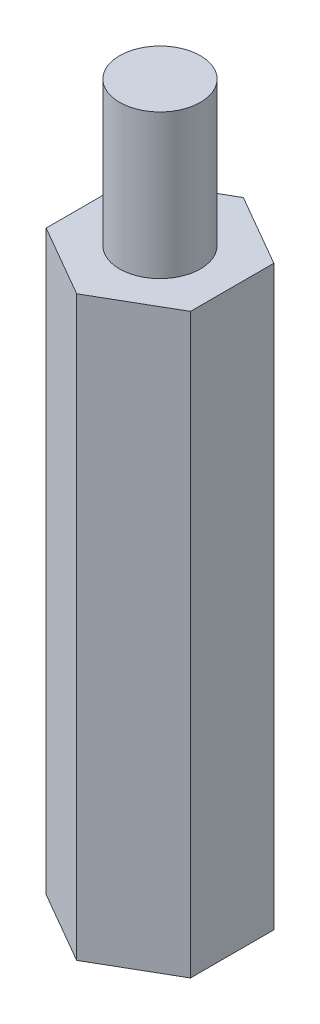
ISO-10303-21;
HEADER;
FILE_DESCRIPTION(('STEP AP214'),'2;1');
FILE_NAME('part.step','',(''),(''),'','','');
FILE_SCHEMA(('AUTOMOTIVE_DESIGN { 1 0 10303 214 1 1 1 1 }'));
ENDSEC;
DATA;
#1=APPLICATION_CONTEXT('core data for automotive mechanical design processes');
#2=APPLICATION_PROTOCOL_DEFINITION('international standard','automotive_design',2000,#1);
#3=PRODUCT_CONTEXT('',#1,'mechanical');
#4=PRODUCT('Part','Part','',(#3));
#5=PRODUCT_RELATED_PRODUCT_CATEGORY('part','',(#4));
#6=PRODUCT_DEFINITION_FORMATION('','',#4);
#7=PRODUCT_DEFINITION_CONTEXT('part definition',#1,'design');
#8=PRODUCT_DEFINITION('design','',#6,#7);
#9=PRODUCT_DEFINITION_SHAPE('','',#8);
#10=(LENGTH_UNIT() NAMED_UNIT(*) SI_UNIT(.MILLI.,.METRE.));
#11=(NAMED_UNIT(*) PLANE_ANGLE_UNIT() SI_UNIT($,.RADIAN.));
#12=(NAMED_UNIT(*) SI_UNIT($,.STERADIAN.) SOLID_ANGLE_UNIT());
#13=UNCERTAINTY_MEASURE_WITH_UNIT(LENGTH_MEASURE(1.E-05),#10,'distance_accuracy_value','');
#14=(GEOMETRIC_REPRESENTATION_CONTEXT(3) GLOBAL_UNCERTAINTY_ASSIGNED_CONTEXT((#13)) GLOBAL_UNIT_ASSIGNED_CONTEXT((#10,
#11,#12)) REPRESENTATION_CONTEXT('',''));
#15=CARTESIAN_POINT('',(0.,0.,0.));
#16=DIRECTION('',(0.,0.,1.));
#17=DIRECTION('',(1.,0.,0.));
#18=AXIS2_PLACEMENT_3D('',#15,#16,#17);
#19=CARTESIAN_POINT('',(3.17499999999998,25.4,-1.8330871046771));
#20=DIRECTION('',(-0.499999999999995,0.,0.866025403784442));
#21=DIRECTION('',(0.866025403784442,0.,0.499999999999995));
#22=AXIS2_PLACEMENT_3D('',#19,#20,#21);
#23=PLANE('',#22);
#24=DIRECTION('',(-0.866025403784442,0.,-0.499999999999995));
#25=VECTOR('',#24,1.);
#26=CARTESIAN_POINT('',(3.17499999999998,0.,-1.8330871046771));
#27=LINE('',#26,#25);
#28=CARTESIAN_POINT('',(3.17499999999998,0.,-1.8330871046771));
#29=VERTEX_POINT('',#28);
#30=CARTESIAN_POINT('',(0.,0.,-3.66617420935413));
#31=VERTEX_POINT('',#30);
#32=EDGE_CURVE('E117',#29,#31,#27,.T.);
#33=ORIENTED_EDGE('',*,*,#32,.T.);
#34=DIRECTION('',(0.,-1.,0.));
#35=VECTOR('',#34,1.);
#36=CARTESIAN_POINT('',(0.,25.4,-3.66617420935413));
#37=LINE('',#36,#35);
#38=CARTESIAN_POINT('',(0.,25.4,-3.66617420935413));
#39=VERTEX_POINT('',#38);
#40=EDGE_CURVE('E11',#39,#31,#37,.T.);
#41=ORIENTED_EDGE('',*,*,#40,.F.);
#42=DIRECTION('',(-0.866025403784442,0.,-0.499999999999995));
#43=VECTOR('',#42,1.);
#44=CARTESIAN_POINT('',(3.17499999999998,25.4,-1.8330871046771));
#45=LINE('',#44,#43);
#46=CARTESIAN_POINT('',(3.17499999999998,25.4,-1.8330871046771));
#47=VERTEX_POINT('',#46);
#48=EDGE_CURVE('E128',#47,#39,#45,.T.);
#49=ORIENTED_EDGE('',*,*,#48,.F.);
#50=DIRECTION('',(0.,-1.,0.));
#51=VECTOR('',#50,1.);
#52=CARTESIAN_POINT('',(3.17499999999998,25.4,-1.8330871046771));
#53=LINE('',#52,#51);
#54=EDGE_CURVE('E113',#47,#29,#53,.T.);
#55=ORIENTED_EDGE('',*,*,#54,.T.);
#56=EDGE_LOOP('',(#33,#41,#49,#55));
#57=FACE_BOUND('',#56,.T.);
#58=ADVANCED_FACE('F33',(#57),#23,.F.);
#59=CARTESIAN_POINT('',(0.,25.4,-3.66617420935413));
#60=DIRECTION('',(0.500000000000001,0.,0.866025403784438));
#61=DIRECTION('',(0.866025403784438,0.,-0.500000000000001));
#62=AXIS2_PLACEMENT_3D('',#59,#60,#61);
#63=PLANE('',#62);
#64=DIRECTION('',(-0.866025403784438,0.,0.500000000000001));
#65=VECTOR('',#64,1.);
#66=CARTESIAN_POINT('',(0.,0.,-3.66617420935413));
#67=LINE('',#66,#65);
#68=CARTESIAN_POINT('',(-3.17500000000001,0.,-1.83308710467706));
#69=VERTEX_POINT('',#68);
#70=EDGE_CURVE('E120',#31,#69,#67,.T.);
#71=ORIENTED_EDGE('',*,*,#70,.T.);
#72=DIRECTION('',(0.,-1.,0.));
#73=VECTOR('',#72,1.);
#74=CARTESIAN_POINT('',(-3.17500000000001,25.4,-1.83308710467706));
#75=LINE('',#74,#73);
#76=CARTESIAN_POINT('',(-3.17500000000001,25.4,-1.83308710467706));
#77=VERTEX_POINT('',#76);
#78=EDGE_CURVE('E41',#77,#69,#75,.T.);
#79=ORIENTED_EDGE('',*,*,#78,.F.);
#80=DIRECTION('',(-0.866025403784438,0.,0.500000000000001));
#81=VECTOR('',#80,1.);
#82=CARTESIAN_POINT('',(0.,25.4,-3.66617420935413));
#83=LINE('',#82,#81);
#84=EDGE_CURVE('E86',#39,#77,#83,.T.);
#85=ORIENTED_EDGE('',*,*,#84,.F.);
#86=ORIENTED_EDGE('',*,*,#40,.T.);
#87=EDGE_LOOP('',(#71,#79,#85,#86));
#88=FACE_BOUND('',#87,.T.);
#89=ADVANCED_FACE('F153',(#88),#63,.F.);
#90=CARTESIAN_POINT('',(-3.17500000000001,25.4,-1.83308710467706));
#91=DIRECTION('',(1.,0.,0.));
#92=DIRECTION('',(0.,0.,-1.));
#93=AXIS2_PLACEMENT_3D('',#90,#91,#92);
#94=PLANE('',#93);
#95=DIRECTION('',(0.,0.,1.));
#96=VECTOR('',#95,1.);
#97=CARTESIAN_POINT('',(-3.17500000000001,0.,-1.83308710467706));
#98=LINE('',#97,#96);
#99=CARTESIAN_POINT('',(-3.17499999999999,0.,1.83308710467708));
#100=VERTEX_POINT('',#99);
#101=EDGE_CURVE('E123',#69,#100,#98,.T.);
#102=ORIENTED_EDGE('',*,*,#101,.T.);
#103=DIRECTION('',(0.,-1.,0.));
#104=VECTOR('',#103,1.);
#105=CARTESIAN_POINT('',(-3.17499999999999,25.4,1.83308710467708));
#106=LINE('',#105,#104);
#107=CARTESIAN_POINT('',(-3.17499999999999,25.4,1.83308710467708));
#108=VERTEX_POINT('',#107);
#109=EDGE_CURVE('E108',#108,#100,#106,.T.);
#110=ORIENTED_EDGE('',*,*,#109,.F.);
#111=DIRECTION('',(0.,0.,1.));
#112=VECTOR('',#111,1.);
#113=CARTESIAN_POINT('',(-3.17500000000001,25.4,-1.83308710467706));
#114=LINE('',#113,#112);
#115=EDGE_CURVE('E99',#77,#108,#114,.T.);
#116=ORIENTED_EDGE('',*,*,#115,.F.);
#117=ORIENTED_EDGE('',*,*,#78,.T.);
#118=EDGE_LOOP('',(#102,#110,#116,#117));
#119=FACE_BOUND('',#118,.T.);
#120=ADVANCED_FACE('F134',(#119),#94,.F.);
#121=CARTESIAN_POINT('',(-3.17499999999999,25.4,1.83308710467708));
#122=DIRECTION('',(0.499999999999995,0.,-0.866025403784441));
#123=DIRECTION('',(-0.866025403784442,0.,-0.499999999999995));
#124=AXIS2_PLACEMENT_3D('',#121,#122,#123);
#125=PLANE('',#124);
#126=DIRECTION('',(0.866025403784441,0.,0.499999999999995));
#127=VECTOR('',#126,1.);
#128=CARTESIAN_POINT('',(-3.17499999999999,0.,1.83308710467708));
#129=LINE('',#128,#127);
#130=CARTESIAN_POINT('',(0.,0.,3.66617420935413));
#131=VERTEX_POINT('',#130);
#132=EDGE_CURVE('E107',#100,#131,#129,.T.);
#133=ORIENTED_EDGE('',*,*,#132,.T.);
#134=DIRECTION('',(0.,-1.,0.));
#135=VECTOR('',#134,1.);
#136=CARTESIAN_POINT('',(0.,25.4,3.66617420935413));
#137=LINE('',#136,#135);
#138=CARTESIAN_POINT('',(0.,25.4,3.66617420935413));
#139=VERTEX_POINT('',#138);
#140=EDGE_CURVE('E104',#139,#131,#137,.T.);
#141=ORIENTED_EDGE('',*,*,#140,.F.);
#142=DIRECTION('',(0.866025403784441,0.,0.499999999999995));
#143=VECTOR('',#142,1.);
#144=CARTESIAN_POINT('',(-3.17499999999999,25.4,1.83308710467708));
#145=LINE('',#144,#143);
#146=EDGE_CURVE('E93',#108,#139,#145,.T.);
#147=ORIENTED_EDGE('',*,*,#146,.F.);
#148=ORIENTED_EDGE('',*,*,#109,.T.);
#149=EDGE_LOOP('',(#133,#141,#147,#148));
#150=FACE_BOUND('',#149,.T.);
#151=ADVANCED_FACE('F105',(#150),#125,.F.);
#152=CARTESIAN_POINT('',(0.,25.4,3.66617420935413));
#153=DIRECTION('',(-0.500000000000007,0.,-0.866025403784435));
#154=DIRECTION('',(-0.866025403784435,0.,0.500000000000007));
#155=AXIS2_PLACEMENT_3D('',#152,#153,#154);
#156=PLANE('',#155);
#157=DIRECTION('',(0.866025403784435,0.,-0.500000000000007));
#158=VECTOR('',#157,1.);
#159=CARTESIAN_POINT('',(0.,0.,3.66617420935413));
#160=LINE('',#159,#158);
#161=CARTESIAN_POINT('',(3.17500000000002,0.,1.83308710467703));
#162=VERTEX_POINT('',#161);
#163=EDGE_CURVE('E72',#131,#162,#160,.T.);
#164=ORIENTED_EDGE('',*,*,#163,.T.);
#165=DIRECTION('',(0.,-1.,0.));
#166=VECTOR('',#165,1.);
#167=CARTESIAN_POINT('',(3.17500000000002,25.4,1.83308710467703));
#168=LINE('',#167,#166);
#169=CARTESIAN_POINT('',(3.17500000000002,25.4,1.83308710467703));
#170=VERTEX_POINT('',#169);
#171=EDGE_CURVE('E109',#170,#162,#168,.T.);
#172=ORIENTED_EDGE('',*,*,#171,.F.);
#173=DIRECTION('',(0.866025403784435,0.,-0.500000000000007));
#174=VECTOR('',#173,1.);
#175=CARTESIAN_POINT('',(0.,25.4,3.66617420935413));
#176=LINE('',#175,#174);
#177=EDGE_CURVE('E97',#139,#170,#176,.T.);
#178=ORIENTED_EDGE('',*,*,#177,.F.);
#179=ORIENTED_EDGE('',*,*,#140,.T.);
#180=EDGE_LOOP('',(#164,#172,#178,#179));
#181=FACE_BOUND('',#180,.T.);
#182=ADVANCED_FACE('F111',(#181),#156,.F.);
#183=CARTESIAN_POINT('',(3.17500000000002,25.4,1.83308710467703));
#184=DIRECTION('',(-1.,0.,0.));
#185=DIRECTION('',(0.,0.,1.));
#186=AXIS2_PLACEMENT_3D('',#183,#184,#185);
#187=PLANE('',#186);
#188=DIRECTION('',(0.,0.,-1.));
#189=VECTOR('',#188,1.);
#190=CARTESIAN_POINT('',(3.17500000000002,0.,1.83308710467703));
#191=LINE('',#190,#189);
#192=EDGE_CURVE('E78',#162,#29,#191,.T.);
#193=ORIENTED_EDGE('',*,*,#192,.T.);
#194=ORIENTED_EDGE('',*,*,#54,.F.);
#195=DIRECTION('',(0.,0.,-1.));
#196=VECTOR('',#195,1.);
#197=CARTESIAN_POINT('',(3.17500000000002,25.4,1.83308710467703));
#198=LINE('',#197,#196);
#199=EDGE_CURVE('E49',#170,#47,#198,.T.);
#200=ORIENTED_EDGE('',*,*,#199,.F.);
#201=ORIENTED_EDGE('',*,*,#171,.T.);
#202=EDGE_LOOP('',(#193,#194,#200,#201));
#203=FACE_BOUND('',#202,.T.);
#204=ADVANCED_FACE('F141',(#203),#187,.F.);
#205=CARTESIAN_POINT('',(0.,25.4,0.));
#206=DIRECTION('',(0.,1.,0.));
#207=DIRECTION('',(0.,0.,1.));
#208=AXIS2_PLACEMENT_3D('',#205,#206,#207);
#209=PLANE('',#208);
#210=CARTESIAN_POINT('',(0.,25.4,0.));
#211=DIRECTION('',(0.,1.,0.));
#212=DIRECTION('',(0.,0.,1.));
#213=AXIS2_PLACEMENT_3D('',#210,#211,#212);
#214=CIRCLE('',#213,1.778);
#215=CARTESIAN_POINT('',(0.,25.4,1.778));
#216=VERTEX_POINT('',#215);
#217=EDGE_CURVE('E214',#216,#216,#214,.T.);
#218=ORIENTED_EDGE('',*,*,#217,.F.);
#219=EDGE_LOOP('',(#218));
#220=FACE_BOUND('',#219,.T.);
#221=ORIENTED_EDGE('',*,*,#48,.T.);
#222=ORIENTED_EDGE('',*,*,#84,.T.);
#223=ORIENTED_EDGE('',*,*,#115,.T.);
#224=ORIENTED_EDGE('',*,*,#146,.T.);
#225=ORIENTED_EDGE('',*,*,#177,.T.);
#226=ORIENTED_EDGE('',*,*,#199,.T.);
#227=EDGE_LOOP('',(#221,#222,#223,#224,#225,#226));
#228=FACE_BOUND('',#227,.T.);
#229=ADVANCED_FACE('F95',(#220,#228),#209,.T.);
#230=CARTESIAN_POINT('',(0.,0.,0.));
#231=DIRECTION('',(0.,1.,0.));
#232=DIRECTION('',(0.,0.,1.));
#233=AXIS2_PLACEMENT_3D('',#230,#231,#232);
#234=PLANE('',#233);
#235=ORIENTED_EDGE('',*,*,#32,.F.);
#236=ORIENTED_EDGE('',*,*,#192,.F.);
#237=ORIENTED_EDGE('',*,*,#163,.F.);
#238=ORIENTED_EDGE('',*,*,#132,.F.);
#239=ORIENTED_EDGE('',*,*,#101,.F.);
#240=ORIENTED_EDGE('',*,*,#70,.F.);
#241=EDGE_LOOP('',(#235,#236,#237,#238,#239,#240));
#242=FACE_BOUND('',#241,.T.);
#243=ADVANCED_FACE('F137',(#242),#234,.F.);
#244=CARTESIAN_POINT('',(0.,31.75,0.));
#245=DIRECTION('',(0.,-1.,0.));
#246=DIRECTION('',(0.,0.,-1.));
#247=AXIS2_PLACEMENT_3D('',#244,#245,#246);
#248=CYLINDRICAL_SURFACE('',#247,1.778);
#249=CARTESIAN_POINT('',(0.,31.75,0.));
#250=DIRECTION('',(0.,1.,0.));
#251=DIRECTION('',(0.,0.,1.));
#252=AXIS2_PLACEMENT_3D('',#249,#250,#251);
#253=CIRCLE('',#252,1.778);
#254=CARTESIAN_POINT('',(0.,31.75,1.778));
#255=VERTEX_POINT('',#254);
#256=EDGE_CURVE('E121',#255,#255,#253,.T.);
#257=ORIENTED_EDGE('',*,*,#256,.F.);
#258=EDGE_LOOP('',(#257));
#259=FACE_BOUND('',#258,.T.);
#260=ORIENTED_EDGE('',*,*,#217,.T.);
#261=EDGE_LOOP('',(#260));
#262=FACE_BOUND('',#261,.T.);
#263=ADVANCED_FACE('F185',(#259,#262),#248,.T.);
#264=CARTESIAN_POINT('',(0.,31.75,0.));
#265=DIRECTION('',(0.,1.,0.));
#266=DIRECTION('',(0.,0.,1.));
#267=AXIS2_PLACEMENT_3D('',#264,#265,#266);
#268=PLANE('',#267);
#269=ORIENTED_EDGE('',*,*,#256,.T.);
#270=EDGE_LOOP('',(#269));
#271=FACE_BOUND('',#270,.T.);
#272=ADVANCED_FACE('F198',(#271),#268,.T.);
#273=CLOSED_SHELL('',(#58,#89,#120,#151,#182,#204,#229,#243,#263,#272));
#274=MANIFOLD_SOLID_BREP('B2',#273);
#275=ADVANCED_BREP_SHAPE_REPRESENTATION('',(#18,#274),#14);
#276=SHAPE_DEFINITION_REPRESENTATION(#9,#275);
ENDSEC;
END-ISO-10303-21;
